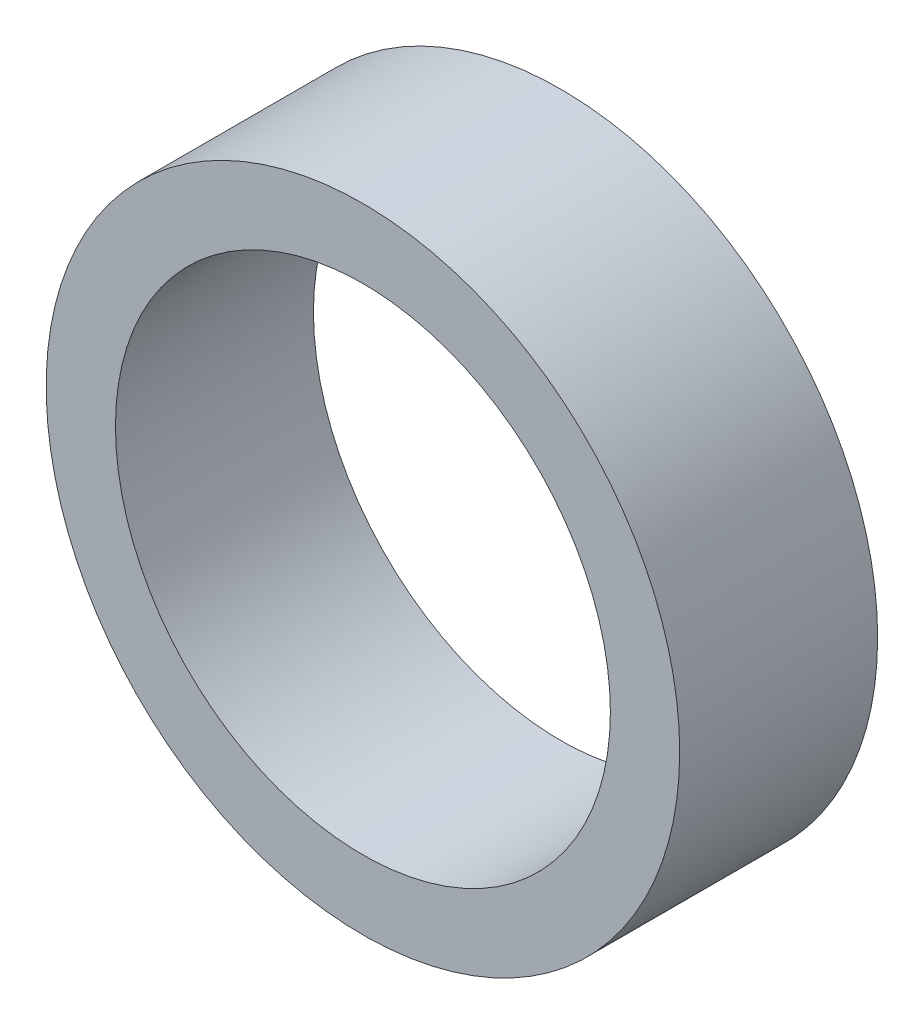
ISO-10303-21;
HEADER;
FILE_DESCRIPTION(('STEP AP214'),'2;1');
FILE_NAME('part.step','',(''),(''),'','','');
FILE_SCHEMA(('AUTOMOTIVE_DESIGN { 1 0 10303 214 1 1 1 1 }'));
ENDSEC;
DATA;
#1=APPLICATION_CONTEXT('core data for automotive mechanical design processes');
#2=APPLICATION_PROTOCOL_DEFINITION('international standard','automotive_design',2000,#1);
#3=PRODUCT_CONTEXT('',#1,'mechanical');
#4=PRODUCT('Part','Part','',(#3));
#5=PRODUCT_RELATED_PRODUCT_CATEGORY('part','',(#4));
#6=PRODUCT_DEFINITION_FORMATION('','',#4);
#7=PRODUCT_DEFINITION_CONTEXT('part definition',#1,'design');
#8=PRODUCT_DEFINITION('design','',#6,#7);
#9=PRODUCT_DEFINITION_SHAPE('','',#8);
#10=(LENGTH_UNIT() NAMED_UNIT(*) SI_UNIT(.MILLI.,.METRE.));
#11=(NAMED_UNIT(*) PLANE_ANGLE_UNIT() SI_UNIT($,.RADIAN.));
#12=(NAMED_UNIT(*) SI_UNIT($,.STERADIAN.) SOLID_ANGLE_UNIT());
#13=UNCERTAINTY_MEASURE_WITH_UNIT(LENGTH_MEASURE(1.E-05),#10,'distance_accuracy_value','');
#14=(GEOMETRIC_REPRESENTATION_CONTEXT(3) GLOBAL_UNCERTAINTY_ASSIGNED_CONTEXT((#13)) GLOBAL_UNIT_ASSIGNED_CONTEXT((#10,
#11,#12)) REPRESENTATION_CONTEXT('',''));
#15=CARTESIAN_POINT('',(0.,0.,0.));
#16=DIRECTION('',(0.,0.,1.));
#17=DIRECTION('',(1.,0.,0.));
#18=AXIS2_PLACEMENT_3D('',#15,#16,#17);
#19=CARTESIAN_POINT('',(0.,0.,2.5));
#20=DIRECTION('',(0.,0.,1.));
#21=DIRECTION('',(1.,0.,0.));
#22=AXIS2_PLACEMENT_3D('',#19,#20,#21);
#23=PLANE('',#22);
#24=CARTESIAN_POINT('',(0.,0.,2.5));
#25=DIRECTION('',(0.,0.,1.));
#26=DIRECTION('',(1.,0.,0.));
#27=AXIS2_PLACEMENT_3D('',#24,#25,#26);
#28=CIRCLE('',#27,4.);
#29=CARTESIAN_POINT('',(4.,0.,2.5));
#30=VERTEX_POINT('',#29);
#31=EDGE_CURVE('E10',#30,#30,#28,.T.);
#32=ORIENTED_EDGE('',*,*,#31,.T.);
#33=EDGE_LOOP('',(#32));
#34=FACE_BOUND('',#33,.T.);
#35=CARTESIAN_POINT('',(0.,0.,2.5));
#36=DIRECTION('',(0.,0.,1.));
#37=DIRECTION('',(1.,0.,0.));
#38=AXIS2_PLACEMENT_3D('',#35,#36,#37);
#39=CIRCLE('',#38,3.125);
#40=CARTESIAN_POINT('',(3.125,0.,2.5));
#41=VERTEX_POINT('',#40);
#42=EDGE_CURVE('E44',#41,#41,#39,.T.);
#43=ORIENTED_EDGE('',*,*,#42,.F.);
#44=EDGE_LOOP('',(#43));
#45=FACE_BOUND('',#44,.T.);
#46=ADVANCED_FACE('F33',(#34,#45),#23,.T.);
#47=CARTESIAN_POINT('',(0.,0.,0.));
#48=DIRECTION('',(0.,0.,1.));
#49=DIRECTION('',(1.,0.,0.));
#50=AXIS2_PLACEMENT_3D('',#47,#48,#49);
#51=PLANE('',#50);
#52=CARTESIAN_POINT('',(0.,0.,0.));
#53=DIRECTION('',(0.,0.,1.));
#54=DIRECTION('',(1.,0.,0.));
#55=AXIS2_PLACEMENT_3D('',#52,#53,#54);
#56=CIRCLE('',#55,4.);
#57=CARTESIAN_POINT('',(4.,0.,0.));
#58=VERTEX_POINT('',#57);
#59=EDGE_CURVE('E37',#58,#58,#56,.T.);
#60=ORIENTED_EDGE('',*,*,#59,.F.);
#61=EDGE_LOOP('',(#60));
#62=FACE_BOUND('',#61,.T.);
#63=CARTESIAN_POINT('',(0.,0.,0.));
#64=DIRECTION('',(0.,0.,1.));
#65=DIRECTION('',(1.,0.,0.));
#66=AXIS2_PLACEMENT_3D('',#63,#64,#65);
#67=CIRCLE('',#66,3.125);
#68=CARTESIAN_POINT('',(3.125,0.,0.));
#69=VERTEX_POINT('',#68);
#70=EDGE_CURVE('E46',#69,#69,#67,.T.);
#71=ORIENTED_EDGE('',*,*,#70,.T.);
#72=EDGE_LOOP('',(#71));
#73=FACE_BOUND('',#72,.T.);
#74=ADVANCED_FACE('F56',(#62,#73),#51,.F.);
#75=CARTESIAN_POINT('',(0.,0.,2.5));
#76=DIRECTION('',(0.,0.,-1.));
#77=DIRECTION('',(-1.,0.,0.));
#78=AXIS2_PLACEMENT_3D('',#75,#76,#77);
#79=CYLINDRICAL_SURFACE('',#78,4.);
#80=ORIENTED_EDGE('',*,*,#31,.F.);
#81=EDGE_LOOP('',(#80));
#82=FACE_BOUND('',#81,.T.);
#83=ORIENTED_EDGE('',*,*,#59,.T.);
#84=EDGE_LOOP('',(#83));
#85=FACE_BOUND('',#84,.T.);
#86=ADVANCED_FACE('F35',(#82,#85),#79,.T.);
#87=CARTESIAN_POINT('',(0.,0.,2.5));
#88=DIRECTION('',(0.,0.,-1.));
#89=DIRECTION('',(-1.,0.,0.));
#90=AXIS2_PLACEMENT_3D('',#87,#88,#89);
#91=CYLINDRICAL_SURFACE('',#90,3.125);
#92=ORIENTED_EDGE('',*,*,#42,.T.);
#93=EDGE_LOOP('',(#92));
#94=FACE_BOUND('',#93,.T.);
#95=ORIENTED_EDGE('',*,*,#70,.F.);
#96=EDGE_LOOP('',(#95));
#97=FACE_BOUND('',#96,.T.);
#98=ADVANCED_FACE('F52',(#94,#97),#91,.F.);
#99=CLOSED_SHELL('',(#46,#74,#86,#98));
#100=MANIFOLD_SOLID_BREP('B2',#99);
#101=ADVANCED_BREP_SHAPE_REPRESENTATION('',(#18,#100),#14);
#102=SHAPE_DEFINITION_REPRESENTATION(#9,#101);
ENDSEC;
END-ISO-10303-21;
